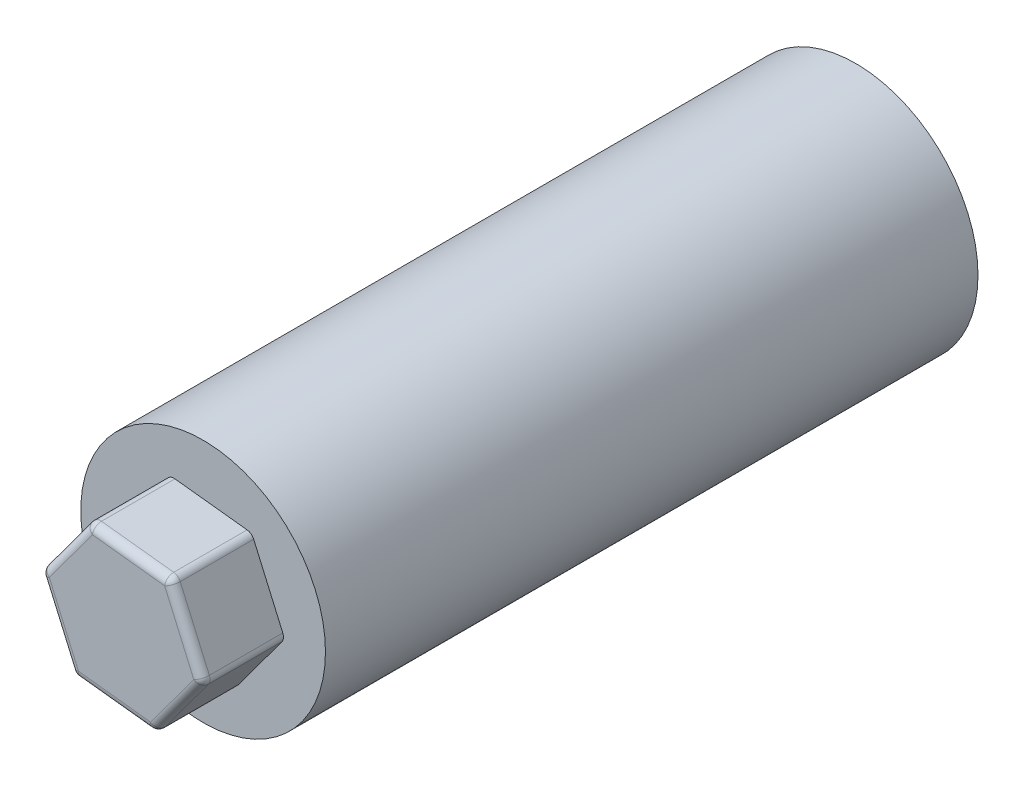
ISO-10303-21;
HEADER;
FILE_DESCRIPTION(('STEP AP214'),'2;1');
FILE_NAME('part.step','',(''),(''),'','','');
FILE_SCHEMA(('AUTOMOTIVE_DESIGN { 1 0 10303 214 1 1 1 1 }'));
ENDSEC;
DATA;
#1=APPLICATION_CONTEXT('core data for automotive mechanical design processes');
#2=APPLICATION_PROTOCOL_DEFINITION('international standard','automotive_design',2000,#1);
#3=PRODUCT_CONTEXT('',#1,'mechanical');
#4=PRODUCT('Part','Part','',(#3));
#5=PRODUCT_RELATED_PRODUCT_CATEGORY('part','',(#4));
#6=PRODUCT_DEFINITION_FORMATION('','',#4);
#7=PRODUCT_DEFINITION_CONTEXT('part definition',#1,'design');
#8=PRODUCT_DEFINITION('design','',#6,#7);
#9=PRODUCT_DEFINITION_SHAPE('','',#8);
#10=(LENGTH_UNIT() NAMED_UNIT(*) SI_UNIT(.MILLI.,.METRE.));
#11=(NAMED_UNIT(*) PLANE_ANGLE_UNIT() SI_UNIT($,.RADIAN.));
#12=(NAMED_UNIT(*) SI_UNIT($,.STERADIAN.) SOLID_ANGLE_UNIT());
#13=UNCERTAINTY_MEASURE_WITH_UNIT(LENGTH_MEASURE(1.E-05),#10,'distance_accuracy_value','');
#14=(GEOMETRIC_REPRESENTATION_CONTEXT(3) GLOBAL_UNCERTAINTY_ASSIGNED_CONTEXT((#13)) GLOBAL_UNIT_ASSIGNED_CONTEXT((#10,
#11,#12)) REPRESENTATION_CONTEXT('',''));
#15=CARTESIAN_POINT('',(0.,0.,0.));
#16=DIRECTION('',(0.,0.,1.));
#17=DIRECTION('',(1.,0.,0.));
#18=AXIS2_PLACEMENT_3D('',#15,#16,#17);
#19=CARTESIAN_POINT('',(0.,0.,80.));
#20=DIRECTION('',(0.,0.,-1.));
#21=DIRECTION('',(-1.,0.,0.));
#22=AXIS2_PLACEMENT_3D('',#19,#20,#21);
#23=CYLINDRICAL_SURFACE('',#22,15.);
#24=CARTESIAN_POINT('',(0.,0.,80.));
#25=DIRECTION('',(0.,0.,1.));
#26=DIRECTION('',(1.,0.,0.));
#27=AXIS2_PLACEMENT_3D('',#24,#25,#26);
#28=CIRCLE('',#27,15.);
#29=CARTESIAN_POINT('',(15.,0.,80.));
#30=VERTEX_POINT('',#29);
#31=EDGE_CURVE('E180',#30,#30,#28,.T.);
#32=ORIENTED_EDGE('',*,*,#31,.F.);
#33=EDGE_LOOP('',(#32));
#34=FACE_BOUND('',#33,.T.);
#35=CARTESIAN_POINT('',(0.,0.,0.));
#36=DIRECTION('',(0.,0.,1.));
#37=DIRECTION('',(1.,0.,0.));
#38=AXIS2_PLACEMENT_3D('',#35,#36,#37);
#39=CIRCLE('',#38,15.);
#40=CARTESIAN_POINT('',(15.,0.,0.));
#41=VERTEX_POINT('',#40);
#42=EDGE_CURVE('E347',#41,#41,#39,.T.);
#43=ORIENTED_EDGE('',*,*,#42,.T.);
#44=EDGE_LOOP('',(#43));
#45=FACE_BOUND('',#44,.T.);
#46=ADVANCED_FACE('F39',(#34,#45),#23,.T.);
#47=CARTESIAN_POINT('',(0.,0.,80.));
#48=DIRECTION('',(0.,0.,1.));
#49=DIRECTION('',(1.,0.,0.));
#50=AXIS2_PLACEMENT_3D('',#47,#48,#49);
#51=PLANE('',#50);
#52=DIRECTION('',(-0.400521797904221,0.91628723084171,0.));
#53=VECTOR('',#52,1.);
#54=CARTESIAN_POINT('',(10.,-1.11977062380222,80.));
#55=LINE('',#54,#53);
#56=CARTESIAN_POINT('',(9.76875863216369,-0.59075194442074,80.));
#57=VERTEX_POINT('',#56);
#58=CARTESIAN_POINT('',(6.20099117446058,7.5713500465618,80.));
#59=VERTEX_POINT('',#58);
#60=EDGE_CURVE('E314',#57,#59,#55,.T.);
#61=ORIENTED_EDGE('',*,*,#60,.F.);
#62=CARTESIAN_POINT('',(8.85247140132198,-0.991273742324961,80.));
#63=DIRECTION('',(0.,0.,1.));
#64=DIRECTION('',(1.,0.,0.));
#65=AXIS2_PLACEMENT_3D('',#62,#63,#64);
#66=CIRCLE('',#65,1.);
#67=CARTESIAN_POINT('',(9.65747706849731,-1.58454086244507,80.));
#68=VERTEX_POINT('',#67);
#69=EDGE_CURVE('E11',#57,#68,#66,.F.);
#70=ORIENTED_EDGE('',*,*,#69,.T.);
#71=DIRECTION('',(0.593267120120107,0.805005667175328,0.));
#72=VECTOR('',#71,1.);
#73=CARTESIAN_POINT('',(4.03025019337574,-9.2201393497455,80.));
#74=LINE('',#73,#72);
#75=CARTESIAN_POINT('',(4.37277312487843,-8.75536911110265,80.));
#76=VERTEX_POINT('',#75);
#77=EDGE_CURVE('E339',#76,#68,#74,.T.);
#78=ORIENTED_EDGE('',*,*,#77,.F.);
#79=CARTESIAN_POINT('',(3.56776745770311,-8.16210199098255,80.));
#80=DIRECTION('',(0.,0.,1.));
#81=DIRECTION('',(1.,0.,0.));
#82=AXIS2_PLACEMENT_3D('',#79,#80,#81);
#83=CIRCLE('',#82,1.);
#84=CARTESIAN_POINT('',(3.45648589403672,-9.15589090900687,80.));
#85=VERTEX_POINT('',#84);
#86=EDGE_CURVE('E244',#76,#85,#83,.F.);
#87=ORIENTED_EDGE('',*,*,#86,.T.);
#88=DIRECTION('',(0.993788918024328,-0.111281563666383,0.));
#89=VECTOR('',#88,1.);
#90=CARTESIAN_POINT('',(-5.96974980662427,-8.10036872594329,80.));
#91=LINE('',#90,#89);
#92=CARTESIAN_POINT('',(-5.39598550728525,-8.16461716668191,80.));
#93=VERTEX_POINT('',#92);
#94=EDGE_CURVE('E335',#93,#85,#91,.T.);
#95=ORIENTED_EDGE('',*,*,#94,.F.);
#96=CARTESIAN_POINT('',(-5.28470394361887,-7.17082824865759,80.));
#97=DIRECTION('',(0.,0.,1.));
#98=DIRECTION('',(1.,0.,0.));
#99=AXIS2_PLACEMENT_3D('',#96,#97,#98);
#100=CIRCLE('',#99,1.);
#101=CARTESIAN_POINT('',(-6.20099117446058,-7.5713500465618,80.));
#102=VERTEX_POINT('',#101);
#103=EDGE_CURVE('E247',#93,#102,#100,.F.);
#104=ORIENTED_EDGE('',*,*,#103,.T.);
#105=DIRECTION('',(0.400521797904221,-0.916287230841711,0.));
#106=VECTOR('',#105,1.);
#107=CARTESIAN_POINT('',(-10.,1.11977062380222,80.));
#108=LINE('',#107,#106);
#109=CARTESIAN_POINT('',(-9.76875863216369,0.590751944420738,80.));
#110=VERTEX_POINT('',#109);
#111=EDGE_CURVE('E331',#110,#102,#108,.T.);
#112=ORIENTED_EDGE('',*,*,#111,.F.);
#113=CARTESIAN_POINT('',(-8.85247140132198,0.99127374232496,80.));
#114=DIRECTION('',(0.,0.,1.));
#115=DIRECTION('',(1.,0.,0.));
#116=AXIS2_PLACEMENT_3D('',#113,#114,#115);
#117=CIRCLE('',#116,1.);
#118=CARTESIAN_POINT('',(-9.65747706849731,1.58454086244506,80.));
#119=VERTEX_POINT('',#118);
#120=EDGE_CURVE('E250',#110,#119,#117,.F.);
#121=ORIENTED_EDGE('',*,*,#120,.T.);
#122=DIRECTION('',(-0.593267120120107,-0.805005667175328,0.));
#123=VECTOR('',#122,1.);
#124=CARTESIAN_POINT('',(-4.03025019337573,9.22013934974549,80.));
#125=LINE('',#124,#123);
#126=CARTESIAN_POINT('',(-4.37277312487843,8.75536911110265,80.));
#127=VERTEX_POINT('',#126);
#128=EDGE_CURVE('E325',#127,#119,#125,.T.);
#129=ORIENTED_EDGE('',*,*,#128,.F.);
#130=CARTESIAN_POINT('',(-3.5677674577031,8.16210199098254,80.));
#131=DIRECTION('',(0.,0.,1.));
#132=DIRECTION('',(1.,0.,0.));
#133=AXIS2_PLACEMENT_3D('',#130,#131,#132);
#134=CIRCLE('',#133,1.);
#135=CARTESIAN_POINT('',(-3.45648589403672,9.15589090900687,80.));
#136=VERTEX_POINT('',#135);
#137=EDGE_CURVE('E253',#127,#136,#134,.F.);
#138=ORIENTED_EDGE('',*,*,#137,.T.);
#139=DIRECTION('',(-0.993788918024328,0.111281563666383,0.));
#140=VECTOR('',#139,1.);
#141=CARTESIAN_POINT('',(5.96974980662427,8.10036872594328,80.));
#142=LINE('',#141,#140);
#143=CARTESIAN_POINT('',(5.39598550728525,8.16461716668191,80.));
#144=VERTEX_POINT('',#143);
#145=EDGE_CURVE('E318',#144,#136,#142,.T.);
#146=ORIENTED_EDGE('',*,*,#145,.F.);
#147=CARTESIAN_POINT('',(5.28470394361887,7.17082824865758,80.));
#148=DIRECTION('',(0.,0.,1.));
#149=DIRECTION('',(1.,0.,0.));
#150=AXIS2_PLACEMENT_3D('',#147,#148,#149);
#151=CIRCLE('',#150,1.);
#152=EDGE_CURVE('E49',#144,#59,#151,.F.);
#153=ORIENTED_EDGE('',*,*,#152,.T.);
#154=EDGE_LOOP('',(#61,#70,#78,#87,#95,#104,#112,#121,#129,#138,#146,#153));
#155=FACE_BOUND('',#154,.T.);
#156=ORIENTED_EDGE('',*,*,#31,.T.);
#157=EDGE_LOOP('',(#156));
#158=FACE_BOUND('',#157,.T.);
#159=ADVANCED_FACE('F394',(#155,#158),#51,.T.);
#160=CARTESIAN_POINT('',(0.,0.,0.));
#161=DIRECTION('',(0.,0.,1.));
#162=DIRECTION('',(1.,0.,0.));
#163=AXIS2_PLACEMENT_3D('',#160,#161,#162);
#164=PLANE('',#163);
#165=CARTESIAN_POINT('',(0.,0.,0.));
#166=DIRECTION('',(0.,0.,-1.));
#167=DIRECTION('',(-1.,0.,0.));
#168=AXIS2_PLACEMENT_3D('',#165,#166,#167);
#169=CIRCLE('',#168,4.);
#170=CARTESIAN_POINT('',(-4.,0.,0.));
#171=VERTEX_POINT('',#170);
#172=EDGE_CURVE('E342',#171,#171,#169,.T.);
#173=ORIENTED_EDGE('',*,*,#172,.F.);
#174=EDGE_LOOP('',(#173));
#175=FACE_BOUND('',#174,.T.);
#176=ORIENTED_EDGE('',*,*,#42,.F.);
#177=EDGE_LOOP('',(#176));
#178=FACE_BOUND('',#177,.T.);
#179=ADVANCED_FACE('F450',(#175,#178),#164,.F.);
#180=CARTESIAN_POINT('',(0.,0.,15.));
#181=DIRECTION('',(0.,0.,-1.));
#182=DIRECTION('',(-1.,0.,0.));
#183=AXIS2_PLACEMENT_3D('',#180,#181,#182);
#184=CYLINDRICAL_SURFACE('',#183,4.);
#185=CARTESIAN_POINT('',(0.,0.,15.));
#186=DIRECTION('',(0.,0.,-1.));
#187=DIRECTION('',(-1.,0.,0.));
#188=AXIS2_PLACEMENT_3D('',#185,#186,#187);
#189=CIRCLE('',#188,4.);
#190=CARTESIAN_POINT('',(-4.,0.,15.));
#191=VERTEX_POINT('',#190);
#192=EDGE_CURVE('E343',#191,#191,#189,.T.);
#193=ORIENTED_EDGE('',*,*,#192,.F.);
#194=EDGE_LOOP('',(#193));
#195=FACE_BOUND('',#194,.T.);
#196=ORIENTED_EDGE('',*,*,#172,.T.);
#197=EDGE_LOOP('',(#196));
#198=FACE_BOUND('',#197,.T.);
#199=ADVANCED_FACE('F552',(#195,#198),#184,.F.);
#200=CARTESIAN_POINT('',(0.,0.,15.));
#201=DIRECTION('',(0.,0.,-1.));
#202=DIRECTION('',(-1.,0.,0.));
#203=AXIS2_PLACEMENT_3D('',#200,#201,#202);
#204=PLANE('',#203);
#205=ORIENTED_EDGE('',*,*,#192,.T.);
#206=EDGE_LOOP('',(#205));
#207=FACE_BOUND('',#206,.T.);
#208=ADVANCED_FACE('F534',(#207),#204,.T.);
#209=CARTESIAN_POINT('',(10.,-1.11977062380222,90.));
#210=DIRECTION('',(-0.91628723084171,-0.400521797904221,0.));
#211=DIRECTION('',(0.400521797904221,-0.916287230841711,0.));
#212=AXIS2_PLACEMENT_3D('',#209,#210,#211);
#213=PLANE('',#212);
#214=ORIENTED_EDGE('',*,*,#60,.T.);
#215=DIRECTION('',(0.,0.,-1.));
#216=VECTOR('',#215,1.);
#217=CARTESIAN_POINT('',(6.20099117446058,7.5713500465618,90.));
#218=LINE('',#217,#216);
#219=CARTESIAN_POINT('',(6.20099117446058,7.5713500465618,89.));
#220=VERTEX_POINT('',#219);
#221=EDGE_CURVE('E234',#59,#220,#218,.F.);
#222=ORIENTED_EDGE('',*,*,#221,.T.);
#223=DIRECTION('',(-0.400521797904221,0.916287230841711,0.));
#224=VECTOR('',#223,1.);
#225=CARTESIAN_POINT('',(10.,-1.11977062380222,89.));
#226=LINE('',#225,#224);
#227=CARTESIAN_POINT('',(9.76875863216369,-0.59075194442074,89.));
#228=VERTEX_POINT('',#227);
#229=EDGE_CURVE('E231',#220,#228,#226,.F.);
#230=ORIENTED_EDGE('',*,*,#229,.T.);
#231=DIRECTION('',(0.,0.,-1.));
#232=VECTOR('',#231,1.);
#233=CARTESIAN_POINT('',(9.76875863216369,-0.59075194442074,90.));
#234=LINE('',#233,#232);
#235=EDGE_CURVE('E228',#228,#57,#234,.T.);
#236=ORIENTED_EDGE('',*,*,#235,.T.);
#237=EDGE_LOOP('',(#214,#222,#230,#236));
#238=FACE_BOUND('',#237,.T.);
#239=ADVANCED_FACE('F525',(#238),#213,.F.);
#240=CARTESIAN_POINT('',(5.96974980662427,8.10036872594328,90.));
#241=DIRECTION('',(-0.111281563666383,-0.993788918024328,0.));
#242=DIRECTION('',(0.993788918024328,-0.111281563666383,0.));
#243=AXIS2_PLACEMENT_3D('',#240,#241,#242);
#244=PLANE('',#243);
#245=ORIENTED_EDGE('',*,*,#145,.T.);
#246=DIRECTION('',(0.,0.,-1.));
#247=VECTOR('',#246,1.);
#248=CARTESIAN_POINT('',(-3.45648589403672,9.15589090900687,90.));
#249=LINE('',#248,#247);
#250=CARTESIAN_POINT('',(-3.45648589403672,9.15589090900687,89.));
#251=VERTEX_POINT('',#250);
#252=EDGE_CURVE('E225',#136,#251,#249,.F.);
#253=ORIENTED_EDGE('',*,*,#252,.T.);
#254=DIRECTION('',(-0.993788918024328,0.111281563666383,0.));
#255=VECTOR('',#254,1.);
#256=CARTESIAN_POINT('',(5.96974980662427,8.10036872594328,89.));
#257=LINE('',#256,#255);
#258=CARTESIAN_POINT('',(5.39598550728525,8.16461716668191,89.));
#259=VERTEX_POINT('',#258);
#260=EDGE_CURVE('E222',#251,#259,#257,.F.);
#261=ORIENTED_EDGE('',*,*,#260,.T.);
#262=DIRECTION('',(0.,0.,-1.));
#263=VECTOR('',#262,1.);
#264=CARTESIAN_POINT('',(5.39598550728525,8.16461716668191,90.));
#265=LINE('',#264,#263);
#266=EDGE_CURVE('E219',#259,#144,#265,.T.);
#267=ORIENTED_EDGE('',*,*,#266,.T.);
#268=EDGE_LOOP('',(#245,#253,#261,#267));
#269=FACE_BOUND('',#268,.T.);
#270=ADVANCED_FACE('F420',(#269),#244,.F.);
#271=CARTESIAN_POINT('',(-4.03025019337573,9.22013934974549,90.));
#272=DIRECTION('',(0.805005667175327,-0.593267120120107,0.));
#273=DIRECTION('',(0.593267120120107,0.805005667175327,0.));
#274=AXIS2_PLACEMENT_3D('',#271,#272,#273);
#275=PLANE('',#274);
#276=ORIENTED_EDGE('',*,*,#128,.T.);
#277=DIRECTION('',(0.,0.,-1.));
#278=VECTOR('',#277,1.);
#279=CARTESIAN_POINT('',(-9.6574770684973,1.58454086244507,90.));
#280=LINE('',#279,#278);
#281=CARTESIAN_POINT('',(-9.6574770684973,1.58454086244507,89.));
#282=VERTEX_POINT('',#281);
#283=EDGE_CURVE('E216',#119,#282,#280,.F.);
#284=ORIENTED_EDGE('',*,*,#283,.T.);
#285=DIRECTION('',(-0.593267120120107,-0.805005667175327,0.));
#286=VECTOR('',#285,1.);
#287=CARTESIAN_POINT('',(-4.03025019337573,9.22013934974549,89.));
#288=LINE('',#287,#286);
#289=CARTESIAN_POINT('',(-4.37277312487843,8.75536911110265,89.));
#290=VERTEX_POINT('',#289);
#291=EDGE_CURVE('E213',#282,#290,#288,.F.);
#292=ORIENTED_EDGE('',*,*,#291,.T.);
#293=DIRECTION('',(0.,0.,-1.));
#294=VECTOR('',#293,1.);
#295=CARTESIAN_POINT('',(-4.37277312487843,8.75536911110265,90.));
#296=LINE('',#295,#294);
#297=EDGE_CURVE('E210',#290,#127,#296,.T.);
#298=ORIENTED_EDGE('',*,*,#297,.T.);
#299=EDGE_LOOP('',(#276,#284,#292,#298));
#300=FACE_BOUND('',#299,.T.);
#301=ADVANCED_FACE('F427',(#300),#275,.F.);
#302=CARTESIAN_POINT('',(-10.,1.11977062380222,90.));
#303=DIRECTION('',(0.916287230841711,0.400521797904221,0.));
#304=DIRECTION('',(-0.400521797904221,0.916287230841711,0.));
#305=AXIS2_PLACEMENT_3D('',#302,#303,#304);
#306=PLANE('',#305);
#307=ORIENTED_EDGE('',*,*,#111,.T.);
#308=DIRECTION('',(0.,0.,-1.));
#309=VECTOR('',#308,1.);
#310=CARTESIAN_POINT('',(-6.20099117446058,-7.5713500465618,90.));
#311=LINE('',#310,#309);
#312=CARTESIAN_POINT('',(-6.20099117446058,-7.57135004656181,89.));
#313=VERTEX_POINT('',#312);
#314=EDGE_CURVE('E207',#102,#313,#311,.F.);
#315=ORIENTED_EDGE('',*,*,#314,.T.);
#316=DIRECTION('',(0.400521797904221,-0.916287230841711,0.));
#317=VECTOR('',#316,1.);
#318=CARTESIAN_POINT('',(-10.,1.11977062380222,89.));
#319=LINE('',#318,#317);
#320=CARTESIAN_POINT('',(-9.76875863216369,0.590751944420738,89.));
#321=VERTEX_POINT('',#320);
#322=EDGE_CURVE('E204',#313,#321,#319,.F.);
#323=ORIENTED_EDGE('',*,*,#322,.T.);
#324=DIRECTION('',(0.,0.,-1.));
#325=VECTOR('',#324,1.);
#326=CARTESIAN_POINT('',(-9.76875863216369,0.590751944420738,90.));
#327=LINE('',#326,#325);
#328=EDGE_CURVE('E201',#321,#110,#327,.T.);
#329=ORIENTED_EDGE('',*,*,#328,.T.);
#330=EDGE_LOOP('',(#307,#315,#323,#329));
#331=FACE_BOUND('',#330,.T.);
#332=ADVANCED_FACE('F435',(#331),#306,.F.);
#333=CARTESIAN_POINT('',(-5.96974980662427,-8.10036872594329,90.));
#334=DIRECTION('',(0.111281563666383,0.993788918024328,0.));
#335=DIRECTION('',(-0.993788918024328,0.111281563666383,0.));
#336=AXIS2_PLACEMENT_3D('',#333,#334,#335);
#337=PLANE('',#336);
#338=ORIENTED_EDGE('',*,*,#94,.T.);
#339=DIRECTION('',(0.,0.,-1.));
#340=VECTOR('',#339,1.);
#341=CARTESIAN_POINT('',(3.45648589403672,-9.15589090900687,90.));
#342=LINE('',#341,#340);
#343=CARTESIAN_POINT('',(3.45648589403672,-9.15589090900687,89.));
#344=VERTEX_POINT('',#343);
#345=EDGE_CURVE('E198',#85,#344,#342,.F.);
#346=ORIENTED_EDGE('',*,*,#345,.T.);
#347=DIRECTION('',(0.993788918024328,-0.111281563666383,0.));
#348=VECTOR('',#347,1.);
#349=CARTESIAN_POINT('',(-5.96974980662427,-8.10036872594329,89.));
#350=LINE('',#349,#348);
#351=CARTESIAN_POINT('',(-5.39598550728525,-8.16461716668191,89.));
#352=VERTEX_POINT('',#351);
#353=EDGE_CURVE('E155',#344,#352,#350,.F.);
#354=ORIENTED_EDGE('',*,*,#353,.T.);
#355=DIRECTION('',(0.,0.,-1.));
#356=VECTOR('',#355,1.);
#357=CARTESIAN_POINT('',(-5.39598550728525,-8.16461716668191,90.));
#358=LINE('',#357,#356);
#359=EDGE_CURVE('E187',#352,#93,#358,.T.);
#360=ORIENTED_EDGE('',*,*,#359,.T.);
#361=EDGE_LOOP('',(#338,#346,#354,#360));
#362=FACE_BOUND('',#361,.T.);
#363=ADVANCED_FACE('F386',(#362),#337,.F.);
#364=CARTESIAN_POINT('',(4.03025019337574,-9.2201393497455,90.));
#365=DIRECTION('',(-0.805005667175328,0.593267120120107,0.));
#366=DIRECTION('',(-0.593267120120107,-0.805005667175328,0.));
#367=AXIS2_PLACEMENT_3D('',#364,#365,#366);
#368=PLANE('',#367);
#369=DIRECTION('',(0.593267120120107,0.805005667175328,0.));
#370=VECTOR('',#369,1.);
#371=CARTESIAN_POINT('',(4.03025019337574,-9.2201393497455,89.));
#372=LINE('',#371,#370);
#373=CARTESIAN_POINT('',(9.65747706849731,-1.58454086244507,89.));
#374=VERTEX_POINT('',#373);
#375=CARTESIAN_POINT('',(4.37277312487843,-8.75536911110265,89.));
#376=VERTEX_POINT('',#375);
#377=EDGE_CURVE('E57',#374,#376,#372,.F.);
#378=ORIENTED_EDGE('',*,*,#377,.T.);
#379=DIRECTION('',(0.,0.,-1.));
#380=VECTOR('',#379,1.);
#381=CARTESIAN_POINT('',(4.37277312487843,-8.75536911110265,90.));
#382=LINE('',#381,#380);
#383=EDGE_CURVE('E241',#376,#76,#382,.T.);
#384=ORIENTED_EDGE('',*,*,#383,.T.);
#385=ORIENTED_EDGE('',*,*,#77,.T.);
#386=DIRECTION('',(0.,0.,-1.));
#387=VECTOR('',#386,1.);
#388=CARTESIAN_POINT('',(9.65747706849731,-1.58454086244507,90.));
#389=LINE('',#388,#387);
#390=EDGE_CURVE('E62',#68,#374,#389,.F.);
#391=ORIENTED_EDGE('',*,*,#390,.T.);
#392=EDGE_LOOP('',(#378,#384,#385,#391));
#393=FACE_BOUND('',#392,.T.);
#394=ADVANCED_FACE('F392',(#393),#368,.F.);
#395=CARTESIAN_POINT('',(0.,0.,90.));
#396=DIRECTION('',(0.,0.,1.));
#397=DIRECTION('',(1.,0.,0.));
#398=AXIS2_PLACEMENT_3D('',#395,#396,#397);
#399=PLANE('',#398);
#400=DIRECTION('',(0.400521797904221,-0.916287230841711,0.));
#401=VECTOR('',#400,1.);
#402=CARTESIAN_POINT('',(-5.05346257578256,-7.69984692803906,90.));
#403=LINE('',#402,#401);
#404=CARTESIAN_POINT('',(-8.85247140132198,0.991273742324958,90.));
#405=VERTEX_POINT('',#404);
#406=CARTESIAN_POINT('',(-5.28470394361887,-7.17082824865759,90.));
#407=VERTEX_POINT('',#406);
#408=EDGE_CURVE('E184',#405,#407,#403,.T.);
#409=ORIENTED_EDGE('',*,*,#408,.T.);
#410=DIRECTION('',(0.993788918024328,-0.111281563666383,0.));
#411=VECTOR('',#410,1.);
#412=CARTESIAN_POINT('',(4.14153175704212,-8.22635043172117,90.));
#413=LINE('',#412,#411);
#414=CARTESIAN_POINT('',(3.5677674577031,-8.16210199098255,90.));
#415=VERTEX_POINT('',#414);
#416=EDGE_CURVE('E153',#407,#415,#413,.T.);
#417=ORIENTED_EDGE('',*,*,#416,.T.);
#418=DIRECTION('',(0.593267120120107,0.805005667175328,0.));
#419=VECTOR('',#418,1.);
#420=CARTESIAN_POINT('',(9.19499433282468,-0.526503503682111,90.));
#421=LINE('',#420,#419);
#422=CARTESIAN_POINT('',(8.85247140132198,-0.991273742324959,90.));
#423=VERTEX_POINT('',#422);
#424=EDGE_CURVE('E172',#415,#423,#421,.T.);
#425=ORIENTED_EDGE('',*,*,#424,.T.);
#426=DIRECTION('',(-0.400521797904221,0.916287230841711,0.));
#427=VECTOR('',#426,1.);
#428=CARTESIAN_POINT('',(5.05346257578256,7.69984692803906,90.));
#429=LINE('',#428,#427);
#430=CARTESIAN_POINT('',(5.28470394361887,7.17082824865758,90.));
#431=VERTEX_POINT('',#430);
#432=EDGE_CURVE('E179',#423,#431,#429,.T.);
#433=ORIENTED_EDGE('',*,*,#432,.T.);
#434=DIRECTION('',(-0.993788918024328,0.111281563666383,0.));
#435=VECTOR('',#434,1.);
#436=CARTESIAN_POINT('',(-4.14153175704212,8.22635043172117,90.));
#437=LINE('',#436,#435);
#438=CARTESIAN_POINT('',(-3.5677674577031,8.16210199098254,90.));
#439=VERTEX_POINT('',#438);
#440=EDGE_CURVE('E359',#431,#439,#437,.T.);
#441=ORIENTED_EDGE('',*,*,#440,.T.);
#442=DIRECTION('',(-0.593267120120107,-0.805005667175327,0.));
#443=VECTOR('',#442,1.);
#444=CARTESIAN_POINT('',(-9.19499433282468,0.526503503682109,90.));
#445=LINE('',#444,#443);
#446=EDGE_CURVE('E192',#439,#405,#445,.T.);
#447=ORIENTED_EDGE('',*,*,#446,.T.);
#448=EDGE_LOOP('',(#409,#417,#425,#433,#441,#447));
#449=FACE_BOUND('',#448,.T.);
#450=ADVANCED_FACE('F182',(#449),#399,.T.);
#451=CARTESIAN_POINT('',(-3.5677674577031,8.16210199098254,90.));
#452=DIRECTION('',(0.,0.,-1.));
#453=DIRECTION('',(-1.,0.,0.));
#454=AXIS2_PLACEMENT_3D('',#451,#452,#453);
#455=CYLINDRICAL_SURFACE('',#454,1.);
#456=ORIENTED_EDGE('',*,*,#137,.F.);
#457=ORIENTED_EDGE('',*,*,#297,.F.);
#458=CARTESIAN_POINT('',(-3.5677674577031,8.16210199098254,89.));
#459=DIRECTION('',(0.,0.,1.));
#460=DIRECTION('',(1.,0.,0.));
#461=AXIS2_PLACEMENT_3D('',#458,#459,#460);
#462=CIRCLE('',#461,1.);
#463=EDGE_CURVE('E43',#251,#290,#462,.T.);
#464=ORIENTED_EDGE('',*,*,#463,.F.);
#465=ORIENTED_EDGE('',*,*,#252,.F.);
#466=EDGE_LOOP('',(#456,#457,#464,#465));
#467=FACE_BOUND('',#466,.T.);
#468=ADVANCED_FACE('F41',(#467),#455,.T.);
#469=CARTESIAN_POINT('',(0.858468242957885,7.66646511982006,89.));
#470=DIRECTION('',(0.993788918024328,-0.111281563666383,0.));
#471=DIRECTION('',(0.111281563666383,0.993788918024328,0.));
#472=AXIS2_PLACEMENT_3D('',#469,#470,#471);
#473=CYLINDRICAL_SURFACE('',#472,1.);
#474=CARTESIAN_POINT('',(5.28470394361887,7.17082824865758,89.));
#475=DIRECTION('',(0.993788918024328,-0.111281563666383,0.));
#476=DIRECTION('',(0.111281563666383,0.993788918024328,0.));
#477=AXIS2_PLACEMENT_3D('',#474,#475,#476);
#478=CIRCLE('',#477,1.);
#479=EDGE_CURVE('E303',#259,#431,#478,.T.);
#480=ORIENTED_EDGE('',*,*,#479,.F.);
#481=ORIENTED_EDGE('',*,*,#260,.F.);
#482=CARTESIAN_POINT('',(-3.5677674577031,8.16210199098254,89.));
#483=DIRECTION('',(-0.993788918024328,0.111281563666384,0.));
#484=DIRECTION('',(-0.111281563666384,-0.993788918024328,0.));
#485=AXIS2_PLACEMENT_3D('',#482,#483,#484);
#486=CIRCLE('',#485,1.);
#487=EDGE_CURVE('E306',#439,#251,#486,.T.);
#488=ORIENTED_EDGE('',*,*,#487,.F.);
#489=ORIENTED_EDGE('',*,*,#440,.F.);
#490=EDGE_LOOP('',(#480,#481,#488,#489));
#491=FACE_BOUND('',#490,.T.);
#492=ADVANCED_FACE('F409',(#491),#473,.T.);
#493=CARTESIAN_POINT('',(5.28470394361887,7.17082824865758,90.));
#494=DIRECTION('',(0.,0.,-1.));
#495=DIRECTION('',(-1.,0.,0.));
#496=AXIS2_PLACEMENT_3D('',#493,#494,#495);
#497=CYLINDRICAL_SURFACE('',#496,1.);
#498=ORIENTED_EDGE('',*,*,#152,.F.);
#499=ORIENTED_EDGE('',*,*,#266,.F.);
#500=CARTESIAN_POINT('',(5.28470394361887,7.17082824865758,89.));
#501=DIRECTION('',(0.,0.,1.));
#502=DIRECTION('',(1.,0.,0.));
#503=AXIS2_PLACEMENT_3D('',#500,#501,#502);
#504=CIRCLE('',#503,1.);
#505=EDGE_CURVE('E299',#220,#259,#504,.T.);
#506=ORIENTED_EDGE('',*,*,#505,.F.);
#507=ORIENTED_EDGE('',*,*,#221,.F.);
#508=EDGE_LOOP('',(#498,#499,#506,#507));
#509=FACE_BOUND('',#508,.T.);
#510=ADVANCED_FACE('F417',(#509),#497,.T.);
#511=CARTESIAN_POINT('',(-3.5677674577031,8.16210199098254,89.));
#512=DIRECTION('',(0.,0.,1.));
#513=DIRECTION('',(0.,-1.,0.));
#514=AXIS2_PLACEMENT_3D('',#511,#512,#513);
#515=SPHERICAL_SURFACE('',#514,1.);
#516=ORIENTED_EDGE('',*,*,#487,.T.);
#517=ORIENTED_EDGE('',*,*,#463,.T.);
#518=CARTESIAN_POINT('',(-3.5677674577031,8.16210199098254,89.));
#519=DIRECTION('',(0.593267120120108,0.805005667175327,0.));
#520=DIRECTION('',(-0.805005667175327,0.593267120120108,0.));
#521=AXIS2_PLACEMENT_3D('',#518,#519,#520);
#522=CIRCLE('',#521,1.);
#523=EDGE_CURVE('E295',#439,#290,#522,.F.);
#524=ORIENTED_EDGE('',*,*,#523,.F.);
#525=EDGE_LOOP('',(#516,#517,#524));
#526=FACE_BOUND('',#525,.T.);
#527=ADVANCED_FACE('F484',(#526),#515,.T.);
#528=CARTESIAN_POINT('',(5.28470394361887,7.17082824865758,89.));
#529=DIRECTION('',(0.,0.,1.));
#530=DIRECTION('',(0.,-1.,0.));
#531=AXIS2_PLACEMENT_3D('',#528,#529,#530);
#532=SPHERICAL_SURFACE('',#531,1.);
#533=ORIENTED_EDGE('',*,*,#505,.T.);
#534=ORIENTED_EDGE('',*,*,#479,.T.);
#535=CARTESIAN_POINT('',(5.28470394361887,7.17082824865758,89.));
#536=DIRECTION('',(-0.400521797904222,0.91628723084171,0.));
#537=DIRECTION('',(-0.91628723084171,-0.400521797904222,0.));
#538=AXIS2_PLACEMENT_3D('',#535,#536,#537);
#539=CIRCLE('',#538,1.);
#540=EDGE_CURVE('E291',#220,#431,#539,.F.);
#541=ORIENTED_EDGE('',*,*,#540,.F.);
#542=EDGE_LOOP('',(#533,#534,#541));
#543=FACE_BOUND('',#542,.T.);
#544=ADVANCED_FACE('F412',(#543),#532,.T.);
#545=CARTESIAN_POINT('',(-8.85247140132198,0.99127374232496,90.));
#546=DIRECTION('',(0.,0.,-1.));
#547=DIRECTION('',(-1.,0.,0.));
#548=AXIS2_PLACEMENT_3D('',#545,#546,#547);
#549=CYLINDRICAL_SURFACE('',#548,1.);
#550=ORIENTED_EDGE('',*,*,#120,.F.);
#551=ORIENTED_EDGE('',*,*,#328,.F.);
#552=CARTESIAN_POINT('',(-8.85247140132198,0.99127374232496,89.));
#553=DIRECTION('',(0.,0.,1.));
#554=DIRECTION('',(1.,0.,0.));
#555=AXIS2_PLACEMENT_3D('',#552,#553,#554);
#556=CIRCLE('',#555,1.);
#557=EDGE_CURVE('E287',#282,#321,#556,.T.);
#558=ORIENTED_EDGE('',*,*,#557,.F.);
#559=ORIENTED_EDGE('',*,*,#283,.F.);
#560=EDGE_LOOP('',(#550,#551,#558,#559));
#561=FACE_BOUND('',#560,.T.);
#562=ADVANCED_FACE('F431',(#561),#549,.T.);
#563=CARTESIAN_POINT('',(-6.21011942951254,4.57668786665375,89.));
#564=DIRECTION('',(0.593267120120107,0.805005667175327,0.));
#565=DIRECTION('',(-0.805005667175327,0.593267120120107,0.));
#566=AXIS2_PLACEMENT_3D('',#563,#564,#565);
#567=CYLINDRICAL_SURFACE('',#566,1.);
#568=ORIENTED_EDGE('',*,*,#523,.T.);
#569=ORIENTED_EDGE('',*,*,#291,.F.);
#570=CARTESIAN_POINT('',(-8.85247140132198,0.991273742324958,89.));
#571=DIRECTION('',(-0.593267120120109,-0.805005667175326,0.));
#572=DIRECTION('',(0.805005667175326,-0.593267120120109,0.));
#573=AXIS2_PLACEMENT_3D('',#570,#571,#572);
#574=CIRCLE('',#573,1.);
#575=EDGE_CURVE('E283',#405,#282,#574,.T.);
#576=ORIENTED_EDGE('',*,*,#575,.F.);
#577=ORIENTED_EDGE('',*,*,#446,.F.);
#578=EDGE_LOOP('',(#568,#569,#576,#577));
#579=FACE_BOUND('',#578,.T.);
#580=ADVANCED_FACE('F368',(#579),#567,.T.);
#581=CARTESIAN_POINT('',(7.06858767247042,3.08977725316631,89.));
#582=DIRECTION('',(0.400521797904221,-0.916287230841711,0.));
#583=DIRECTION('',(0.91628723084171,0.400521797904221,0.));
#584=AXIS2_PLACEMENT_3D('',#581,#582,#583);
#585=CYLINDRICAL_SURFACE('',#584,1.);
#586=ORIENTED_EDGE('',*,*,#540,.T.);
#587=ORIENTED_EDGE('',*,*,#432,.F.);
#588=CARTESIAN_POINT('',(8.85247140132198,-0.991273742324961,89.));
#589=DIRECTION('',(0.400521797904221,-0.91628723084171,0.));
#590=DIRECTION('',(0.916287230841711,0.400521797904222,0.));
#591=AXIS2_PLACEMENT_3D('',#588,#589,#590);
#592=CIRCLE('',#591,1.);
#593=EDGE_CURVE('E279',#228,#423,#592,.T.);
#594=ORIENTED_EDGE('',*,*,#593,.F.);
#595=ORIENTED_EDGE('',*,*,#229,.F.);
#596=EDGE_LOOP('',(#586,#587,#594,#595));
#597=FACE_BOUND('',#596,.T.);
#598=ADVANCED_FACE('F405',(#597),#585,.T.);
#599=CARTESIAN_POINT('',(8.85247140132198,-0.991273742324961,90.));
#600=DIRECTION('',(0.,0.,-1.));
#601=DIRECTION('',(-1.,0.,0.));
#602=AXIS2_PLACEMENT_3D('',#599,#600,#601);
#603=CYLINDRICAL_SURFACE('',#602,1.);
#604=ORIENTED_EDGE('',*,*,#69,.F.);
#605=ORIENTED_EDGE('',*,*,#235,.F.);
#606=CARTESIAN_POINT('',(8.85247140132198,-0.99127374232496,89.));
#607=DIRECTION('',(0.,0.,1.));
#608=DIRECTION('',(1.,0.,0.));
#609=AXIS2_PLACEMENT_3D('',#606,#607,#608);
#610=CIRCLE('',#609,1.);
#611=EDGE_CURVE('E275',#374,#228,#610,.T.);
#612=ORIENTED_EDGE('',*,*,#611,.F.);
#613=ORIENTED_EDGE('',*,*,#390,.F.);
#614=EDGE_LOOP('',(#604,#605,#612,#613));
#615=FACE_BOUND('',#614,.T.);
#616=ADVANCED_FACE('F399',(#615),#603,.T.);
#617=CARTESIAN_POINT('',(-8.85247140132198,0.991273742324959,89.));
#618=DIRECTION('',(0.,0.,1.));
#619=DIRECTION('',(1.,0.,0.));
#620=AXIS2_PLACEMENT_3D('',#617,#618,#619);
#621=SPHERICAL_SURFACE('',#620,1.);
#622=ORIENTED_EDGE('',*,*,#575,.T.);
#623=ORIENTED_EDGE('',*,*,#557,.T.);
#624=CARTESIAN_POINT('',(-8.85247140132198,0.991273742324959,89.));
#625=DIRECTION('',(-0.400521797904221,0.916287230841711,0.));
#626=DIRECTION('',(-0.916287230841711,-0.400521797904221,0.));
#627=AXIS2_PLACEMENT_3D('',#624,#625,#626);
#628=CIRCLE('',#627,1.);
#629=EDGE_CURVE('E271',#405,#321,#628,.F.);
#630=ORIENTED_EDGE('',*,*,#629,.F.);
#631=EDGE_LOOP('',(#622,#623,#630));
#632=FACE_BOUND('',#631,.T.);
#633=ADVANCED_FACE('F371',(#632),#621,.T.);
#634=CARTESIAN_POINT('',(8.85247140132198,-0.991273742324961,89.));
#635=DIRECTION('',(0.,0.,1.));
#636=DIRECTION('',(0.,-1.,0.));
#637=AXIS2_PLACEMENT_3D('',#634,#635,#636);
#638=SPHERICAL_SURFACE('',#637,1.);
#639=ORIENTED_EDGE('',*,*,#611,.T.);
#640=ORIENTED_EDGE('',*,*,#593,.T.);
#641=CARTESIAN_POINT('',(8.85247140132198,-0.991273742324959,89.));
#642=DIRECTION('',(0.593267120120109,0.805005667175326,0.));
#643=DIRECTION('',(-0.805005667175326,0.593267120120109,0.));
#644=AXIS2_PLACEMENT_3D('',#641,#642,#643);
#645=CIRCLE('',#644,1.);
#646=EDGE_CURVE('E175',#374,#423,#645,.F.);
#647=ORIENTED_EDGE('',*,*,#646,.F.);
#648=EDGE_LOOP('',(#639,#640,#647));
#649=FACE_BOUND('',#648,.T.);
#650=ADVANCED_FACE('F402',(#649),#638,.T.);
#651=CARTESIAN_POINT('',(-5.28470394361887,-7.17082824865759,90.));
#652=DIRECTION('',(0.,0.,-1.));
#653=DIRECTION('',(-1.,0.,0.));
#654=AXIS2_PLACEMENT_3D('',#651,#652,#653);
#655=CYLINDRICAL_SURFACE('',#654,1.);
#656=ORIENTED_EDGE('',*,*,#103,.F.);
#657=ORIENTED_EDGE('',*,*,#359,.F.);
#658=CARTESIAN_POINT('',(-5.28470394361887,-7.17082824865758,89.));
#659=DIRECTION('',(0.,0.,1.));
#660=DIRECTION('',(1.,0.,0.));
#661=AXIS2_PLACEMENT_3D('',#658,#659,#660);
#662=CIRCLE('',#661,1.);
#663=EDGE_CURVE('E265',#313,#352,#662,.T.);
#664=ORIENTED_EDGE('',*,*,#663,.F.);
#665=ORIENTED_EDGE('',*,*,#314,.F.);
#666=EDGE_LOOP('',(#656,#657,#664,#665));
#667=FACE_BOUND('',#666,.T.);
#668=ADVANCED_FACE('F383',(#667),#655,.T.);
#669=CARTESIAN_POINT('',(-7.06858767247043,-3.08977725316631,89.));
#670=DIRECTION('',(-0.400521797904221,0.916287230841711,0.));
#671=DIRECTION('',(-0.916287230841711,-0.400521797904221,0.));
#672=AXIS2_PLACEMENT_3D('',#669,#670,#671);
#673=CYLINDRICAL_SURFACE('',#672,1.);
#674=ORIENTED_EDGE('',*,*,#629,.T.);
#675=ORIENTED_EDGE('',*,*,#322,.F.);
#676=CARTESIAN_POINT('',(-5.28470394361887,-7.17082824865759,89.));
#677=DIRECTION('',(0.400521797904221,-0.916287230841711,0.));
#678=DIRECTION('',(0.916287230841711,0.400521797904221,0.));
#679=AXIS2_PLACEMENT_3D('',#676,#677,#678);
#680=CIRCLE('',#679,1.);
#681=EDGE_CURVE('E169',#407,#313,#680,.T.);
#682=ORIENTED_EDGE('',*,*,#681,.F.);
#683=ORIENTED_EDGE('',*,*,#408,.F.);
#684=EDGE_LOOP('',(#674,#675,#682,#683));
#685=FACE_BOUND('',#684,.T.);
#686=ADVANCED_FACE('F374',(#685),#673,.T.);
#687=CARTESIAN_POINT('',(6.21011942951254,-4.57668786665375,89.));
#688=DIRECTION('',(-0.593267120120107,-0.805005667175328,0.));
#689=DIRECTION('',(0.805005667175328,-0.593267120120107,0.));
#690=AXIS2_PLACEMENT_3D('',#687,#688,#689);
#691=CYLINDRICAL_SURFACE('',#690,1.);
#692=ORIENTED_EDGE('',*,*,#646,.T.);
#693=ORIENTED_EDGE('',*,*,#424,.F.);
#694=CARTESIAN_POINT('',(3.56776745770311,-8.16210199098255,89.));
#695=DIRECTION('',(-0.593267120120107,-0.805005667175328,0.));
#696=DIRECTION('',(0.805005667175328,-0.593267120120107,0.));
#697=AXIS2_PLACEMENT_3D('',#694,#695,#696);
#698=CIRCLE('',#697,1.);
#699=EDGE_CURVE('E162',#376,#415,#698,.T.);
#700=ORIENTED_EDGE('',*,*,#699,.F.);
#701=ORIENTED_EDGE('',*,*,#377,.F.);
#702=EDGE_LOOP('',(#692,#693,#700,#701));
#703=FACE_BOUND('',#702,.T.);
#704=ADVANCED_FACE('F173',(#703),#691,.T.);
#705=CARTESIAN_POINT('',(3.56776745770311,-8.16210199098255,90.));
#706=DIRECTION('',(0.,0.,-1.));
#707=DIRECTION('',(-1.,0.,0.));
#708=AXIS2_PLACEMENT_3D('',#705,#706,#707);
#709=CYLINDRICAL_SURFACE('',#708,1.);
#710=ORIENTED_EDGE('',*,*,#86,.F.);
#711=ORIENTED_EDGE('',*,*,#383,.F.);
#712=CARTESIAN_POINT('',(3.56776745770311,-8.16210199098254,89.));
#713=DIRECTION('',(0.,0.,1.));
#714=DIRECTION('',(1.,0.,0.));
#715=AXIS2_PLACEMENT_3D('',#712,#713,#714);
#716=CIRCLE('',#715,1.);
#717=EDGE_CURVE('E166',#344,#376,#716,.T.);
#718=ORIENTED_EDGE('',*,*,#717,.F.);
#719=ORIENTED_EDGE('',*,*,#345,.F.);
#720=EDGE_LOOP('',(#710,#711,#718,#719));
#721=FACE_BOUND('',#720,.T.);
#722=ADVANCED_FACE('F390',(#721),#709,.T.);
#723=CARTESIAN_POINT('',(-5.28470394361887,-7.17082824865759,89.));
#724=DIRECTION('',(0.,0.,1.));
#725=DIRECTION('',(1.,0.,0.));
#726=AXIS2_PLACEMENT_3D('',#723,#724,#725);
#727=SPHERICAL_SURFACE('',#726,1.);
#728=ORIENTED_EDGE('',*,*,#681,.T.);
#729=ORIENTED_EDGE('',*,*,#663,.T.);
#730=CARTESIAN_POINT('',(-5.28470394361887,-7.17082824865759,89.));
#731=DIRECTION('',(-0.993788918024328,0.111281563666383,0.));
#732=DIRECTION('',(-0.111281563666383,-0.993788918024328,0.));
#733=AXIS2_PLACEMENT_3D('',#730,#731,#732);
#734=CIRCLE('',#733,1.);
#735=EDGE_CURVE('E159',#407,#352,#734,.F.);
#736=ORIENTED_EDGE('',*,*,#735,.F.);
#737=EDGE_LOOP('',(#728,#729,#736));
#738=FACE_BOUND('',#737,.T.);
#739=ADVANCED_FACE('F378',(#738),#727,.T.);
#740=CARTESIAN_POINT('',(3.56776745770311,-8.16210199098255,89.));
#741=DIRECTION('',(0.,0.,1.));
#742=DIRECTION('',(1.,0.,0.));
#743=AXIS2_PLACEMENT_3D('',#740,#741,#742);
#744=SPHERICAL_SURFACE('',#743,1.);
#745=ORIENTED_EDGE('',*,*,#717,.T.);
#746=ORIENTED_EDGE('',*,*,#699,.T.);
#747=CARTESIAN_POINT('',(3.5677674577031,-8.16210199098255,89.));
#748=DIRECTION('',(0.993788918024328,-0.111281563666381,0.));
#749=DIRECTION('',(0.111281563666381,0.993788918024328,0.));
#750=AXIS2_PLACEMENT_3D('',#747,#748,#749);
#751=CIRCLE('',#750,1.);
#752=EDGE_CURVE('E149',#344,#415,#751,.F.);
#753=ORIENTED_EDGE('',*,*,#752,.F.);
#754=EDGE_LOOP('',(#745,#746,#753));
#755=FACE_BOUND('',#754,.T.);
#756=ADVANCED_FACE('F164',(#755),#744,.T.);
#757=CARTESIAN_POINT('',(-0.858468242957886,-7.66646511982007,89.));
#758=DIRECTION('',(-0.993788918024328,0.111281563666383,0.));
#759=DIRECTION('',(-0.111281563666383,-0.993788918024328,0.));
#760=AXIS2_PLACEMENT_3D('',#757,#758,#759);
#761=CYLINDRICAL_SURFACE('',#760,1.);
#762=ORIENTED_EDGE('',*,*,#735,.T.);
#763=ORIENTED_EDGE('',*,*,#353,.F.);
#764=ORIENTED_EDGE('',*,*,#752,.T.);
#765=ORIENTED_EDGE('',*,*,#416,.F.);
#766=EDGE_LOOP('',(#762,#763,#764,#765));
#767=FACE_BOUND('',#766,.T.);
#768=ADVANCED_FACE('F151',(#767),#761,.T.);
#769=CLOSED_SHELL('',(#46,#159,#179,#199,#208,#239,#270,#301,#332,#363,#394,#450,#468,#492,#510,
#527,#544,#562,#580,#598,#616,#633,#650,#668,#686,#704,#722,#739,#756,#768));
#770=MANIFOLD_SOLID_BREP('B2',#769);
#771=ADVANCED_BREP_SHAPE_REPRESENTATION('',(#18,#770),#14);
#772=SHAPE_DEFINITION_REPRESENTATION(#9,#771);
ENDSEC;
END-ISO-10303-21;
